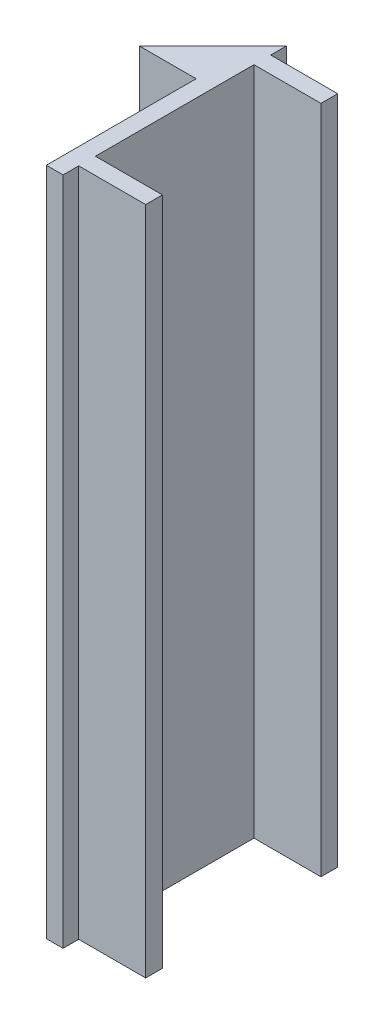
ISO-10303-21;
HEADER;
FILE_DESCRIPTION(('STEP AP214'),'2;1');
FILE_NAME('part.step','',(''),(''),'','','');
FILE_SCHEMA(('AUTOMOTIVE_DESIGN { 1 0 10303 214 1 1 1 1 }'));
ENDSEC;
DATA;
#1=APPLICATION_CONTEXT('core data for automotive mechanical design processes');
#2=APPLICATION_PROTOCOL_DEFINITION('international standard','automotive_design',2000,#1);
#3=PRODUCT_CONTEXT('',#1,'mechanical');
#4=PRODUCT('Part','Part','',(#3));
#5=PRODUCT_RELATED_PRODUCT_CATEGORY('part','',(#4));
#6=PRODUCT_DEFINITION_FORMATION('','',#4);
#7=PRODUCT_DEFINITION_CONTEXT('part definition',#1,'design');
#8=PRODUCT_DEFINITION('design','',#6,#7);
#9=PRODUCT_DEFINITION_SHAPE('','',#8);
#10=(LENGTH_UNIT() NAMED_UNIT(*) SI_UNIT(.MILLI.,.METRE.));
#11=(NAMED_UNIT(*) PLANE_ANGLE_UNIT() SI_UNIT($,.RADIAN.));
#12=(NAMED_UNIT(*) SI_UNIT($,.STERADIAN.) SOLID_ANGLE_UNIT());
#13=UNCERTAINTY_MEASURE_WITH_UNIT(LENGTH_MEASURE(1.E-05),#10,'distance_accuracy_value','');
#14=(GEOMETRIC_REPRESENTATION_CONTEXT(3) GLOBAL_UNCERTAINTY_ASSIGNED_CONTEXT((#13)) GLOBAL_UNIT_ASSIGNED_CONTEXT((#10,
#11,#12)) REPRESENTATION_CONTEXT('',''));
#15=CARTESIAN_POINT('',(0.,0.,0.));
#16=DIRECTION('',(0.,0.,1.));
#17=DIRECTION('',(1.,0.,0.));
#18=AXIS2_PLACEMENT_3D('',#15,#16,#17);
#19=CARTESIAN_POINT('',(12.7,25.,25.1));
#20=DIRECTION('',(0.,0.,-1.));
#21=DIRECTION('',(-1.,0.,0.));
#22=AXIS2_PLACEMENT_3D('',#19,#20,#21);
#23=CYLINDRICAL_SURFACE('',#22,2.49999999999999);
#24=CARTESIAN_POINT('',(12.7,25.,0.));
#25=DIRECTION('',(0.,0.,-1.));
#26=DIRECTION('',(-1.,0.,0.));
#27=AXIS2_PLACEMENT_3D('',#24,#25,#26);
#28=CIRCLE('',#27,2.49999999999999);
#29=CARTESIAN_POINT('',(10.2,25.,0.));
#30=VERTEX_POINT('',#29);
#31=EDGE_CURVE('E221',#30,#30,#28,.F.);
#32=ORIENTED_EDGE('',*,*,#31,.T.);
#33=EDGE_LOOP('',(#32));
#34=FACE_BOUND('',#33,.T.);
#35=CARTESIAN_POINT('',(12.7,25.,-6.90000000000002));
#36=DIRECTION('',(0.,0.,-1.));
#37=DIRECTION('',(-1.,0.,0.));
#38=AXIS2_PLACEMENT_3D('',#35,#36,#37);
#39=CIRCLE('',#38,2.49999999999999);
#40=CARTESIAN_POINT('',(10.2,25.,-6.90000000000002));
#41=VERTEX_POINT('',#40);
#42=EDGE_CURVE('E242',#41,#41,#39,.T.);
#43=ORIENTED_EDGE('',*,*,#42,.T.);
#44=EDGE_LOOP('',(#43));
#45=FACE_BOUND('',#44,.T.);
#46=ADVANCED_FACE('F39',(#34,#45),#23,.F.);
#47=CARTESIAN_POINT('',(12.7,99.9999999999999,25.1));
#48=DIRECTION('',(0.,0.,-1.));
#49=DIRECTION('',(-1.,0.,0.));
#50=AXIS2_PLACEMENT_3D('',#47,#48,#49);
#51=CYLINDRICAL_SURFACE('',#50,2.5);
#52=CARTESIAN_POINT('',(12.7,99.9999999999999,0.));
#53=DIRECTION('',(0.,0.,-1.));
#54=DIRECTION('',(-1.,0.,0.));
#55=AXIS2_PLACEMENT_3D('',#52,#53,#54);
#56=CIRCLE('',#55,2.5);
#57=CARTESIAN_POINT('',(10.2,99.9999999999999,0.));
#58=VERTEX_POINT('',#57);
#59=EDGE_CURVE('E224',#58,#58,#56,.F.);
#60=ORIENTED_EDGE('',*,*,#59,.T.);
#61=EDGE_LOOP('',(#60));
#62=FACE_BOUND('',#61,.T.);
#63=CARTESIAN_POINT('',(12.7,99.9999999999999,-6.90000000000002));
#64=DIRECTION('',(0.,0.,-1.));
#65=DIRECTION('',(-1.,0.,0.));
#66=AXIS2_PLACEMENT_3D('',#63,#64,#65);
#67=CIRCLE('',#66,2.5);
#68=CARTESIAN_POINT('',(10.2,99.9999999999999,-6.90000000000002));
#69=VERTEX_POINT('',#68);
#70=EDGE_CURVE('E239',#69,#69,#67,.T.);
#71=ORIENTED_EDGE('',*,*,#70,.T.);
#72=EDGE_LOOP('',(#71));
#73=FACE_BOUND('',#72,.T.);
#74=ADVANCED_FACE('F277',(#62,#73),#51,.F.);
#75=CARTESIAN_POINT('',(12.7,200.,25.1));
#76=DIRECTION('',(0.,0.,-1.));
#77=DIRECTION('',(-1.,0.,0.));
#78=AXIS2_PLACEMENT_3D('',#75,#76,#77);
#79=CYLINDRICAL_SURFACE('',#78,2.5);
#80=CARTESIAN_POINT('',(12.7,200.,0.));
#81=DIRECTION('',(0.,0.,-1.));
#82=DIRECTION('',(-1.,0.,0.));
#83=AXIS2_PLACEMENT_3D('',#80,#81,#82);
#84=CIRCLE('',#83,2.5);
#85=CARTESIAN_POINT('',(10.2,200.,0.));
#86=VERTEX_POINT('',#85);
#87=EDGE_CURVE('E227',#86,#86,#84,.F.);
#88=ORIENTED_EDGE('',*,*,#87,.T.);
#89=EDGE_LOOP('',(#88));
#90=FACE_BOUND('',#89,.T.);
#91=CARTESIAN_POINT('',(12.7,200.,-6.90000000000002));
#92=DIRECTION('',(0.,0.,-1.));
#93=DIRECTION('',(-1.,0.,0.));
#94=AXIS2_PLACEMENT_3D('',#91,#92,#93);
#95=CIRCLE('',#94,2.5);
#96=CARTESIAN_POINT('',(10.2,200.,-6.90000000000002));
#97=VERTEX_POINT('',#96);
#98=EDGE_CURVE('E235',#97,#97,#95,.T.);
#99=ORIENTED_EDGE('',*,*,#98,.T.);
#100=EDGE_LOOP('',(#99));
#101=FACE_BOUND('',#100,.T.);
#102=ADVANCED_FACE('F284',(#90,#101),#79,.F.);
#103=CARTESIAN_POINT('',(12.7,275.,25.1));
#104=DIRECTION('',(0.,0.,-1.));
#105=DIRECTION('',(-1.,0.,0.));
#106=AXIS2_PLACEMENT_3D('',#103,#104,#105);
#107=CYLINDRICAL_SURFACE('',#106,2.5);
#108=CARTESIAN_POINT('',(12.7,275.,0.));
#109=DIRECTION('',(0.,0.,-1.));
#110=DIRECTION('',(-1.,0.,0.));
#111=AXIS2_PLACEMENT_3D('',#108,#109,#110);
#112=CIRCLE('',#111,2.5);
#113=CARTESIAN_POINT('',(10.2,275.,0.));
#114=VERTEX_POINT('',#113);
#115=EDGE_CURVE('E172',#114,#114,#112,.F.);
#116=ORIENTED_EDGE('',*,*,#115,.T.);
#117=EDGE_LOOP('',(#116));
#118=FACE_BOUND('',#117,.T.);
#119=CARTESIAN_POINT('',(12.7,275.,-6.90000000000002));
#120=DIRECTION('',(0.,0.,-1.));
#121=DIRECTION('',(-1.,0.,0.));
#122=AXIS2_PLACEMENT_3D('',#119,#120,#121);
#123=CIRCLE('',#122,2.5);
#124=CARTESIAN_POINT('',(10.2,275.,-6.90000000000002));
#125=VERTEX_POINT('',#124);
#126=EDGE_CURVE('E232',#125,#125,#123,.T.);
#127=ORIENTED_EDGE('',*,*,#126,.T.);
#128=EDGE_LOOP('',(#127));
#129=FACE_BOUND('',#128,.T.);
#130=ADVANCED_FACE('F336',(#118,#129),#107,.F.);
#131=CARTESIAN_POINT('',(0.,300.,0.));
#132=DIRECTION('',(0.707106781186548,0.,0.707106781186547));
#133=DIRECTION('',(0.707106781186547,0.,-0.707106781186548));
#134=AXIS2_PLACEMENT_3D('',#131,#132,#133);
#135=PLANE('',#134);
#136=CARTESIAN_POINT('',(12.7,275.,-12.7));
#137=DIRECTION('',(0.707106781186548,0.,0.707106781186547));
#138=DIRECTION('',(0.707106781186547,0.,-0.707106781186548));
#139=AXIS2_PLACEMENT_3D('',#136,#137,#138);
#140=ELLIPSE('',#139,7.07106781186548,5.);
#141=CARTESIAN_POINT('',(17.7,275.,-17.7));
#142=VERTEX_POINT('',#141);
#143=EDGE_CURVE('E43',#142,#142,#140,.T.);
#144=ORIENTED_EDGE('',*,*,#143,.T.);
#145=EDGE_LOOP('',(#144));
#146=FACE_BOUND('',#145,.T.);
#147=CARTESIAN_POINT('',(12.7,200.,-12.7));
#148=DIRECTION('',(0.707106781186548,0.,0.707106781186547));
#149=DIRECTION('',(0.707106781186547,0.,-0.707106781186548));
#150=AXIS2_PLACEMENT_3D('',#147,#148,#149);
#151=ELLIPSE('',#150,7.07106781186548,5.);
#152=CARTESIAN_POINT('',(17.7,200.,-17.7));
#153=VERTEX_POINT('',#152);
#154=EDGE_CURVE('E250',#153,#153,#151,.T.);
#155=ORIENTED_EDGE('',*,*,#154,.T.);
#156=EDGE_LOOP('',(#155));
#157=FACE_BOUND('',#156,.T.);
#158=CARTESIAN_POINT('',(12.7,99.9999999999999,-12.7));
#159=DIRECTION('',(0.707106781186548,0.,0.707106781186547));
#160=DIRECTION('',(0.707106781186547,0.,-0.707106781186548));
#161=AXIS2_PLACEMENT_3D('',#158,#159,#160);
#162=ELLIPSE('',#161,7.07106781186548,5.);
#163=CARTESIAN_POINT('',(17.7,99.9999999999999,-17.7));
#164=VERTEX_POINT('',#163);
#165=EDGE_CURVE('E248',#164,#164,#162,.T.);
#166=ORIENTED_EDGE('',*,*,#165,.T.);
#167=EDGE_LOOP('',(#166));
#168=FACE_BOUND('',#167,.T.);
#169=CARTESIAN_POINT('',(12.7,25.,-12.7));
#170=DIRECTION('',(0.707106781186548,0.,0.707106781186547));
#171=DIRECTION('',(0.707106781186547,0.,-0.707106781186548));
#172=AXIS2_PLACEMENT_3D('',#169,#170,#171);
#173=ELLIPSE('',#172,7.07106781186548,5.);
#174=CARTESIAN_POINT('',(17.7,25.,-17.7));
#175=VERTEX_POINT('',#174);
#176=EDGE_CURVE('E245',#175,#175,#173,.T.);
#177=ORIENTED_EDGE('',*,*,#176,.T.);
#178=EDGE_LOOP('',(#177));
#179=FACE_BOUND('',#178,.T.);
#180=DIRECTION('',(-0.707106781186547,0.,0.707106781186548));
#181=VECTOR('',#180,1.);
#182=CARTESIAN_POINT('',(0.,0.,0.));
#183=LINE('',#182,#181);
#184=CARTESIAN_POINT('',(32.9,0.,-32.9));
#185=VERTEX_POINT('',#184);
#186=CARTESIAN_POINT('',(0.,0.,0.));
#187=VERTEX_POINT('',#186);
#188=EDGE_CURVE('E168',#185,#187,#183,.T.);
#189=ORIENTED_EDGE('',*,*,#188,.T.);
#190=DIRECTION('',(0.,-1.,0.));
#191=VECTOR('',#190,1.);
#192=CARTESIAN_POINT('',(0.,300.,0.));
#193=LINE('',#192,#191);
#194=CARTESIAN_POINT('',(0.,300.,0.));
#195=VERTEX_POINT('',#194);
#196=EDGE_CURVE('E11',#195,#187,#193,.T.);
#197=ORIENTED_EDGE('',*,*,#196,.F.);
#198=DIRECTION('',(-0.707106781186547,0.,0.707106781186548));
#199=VECTOR('',#198,1.);
#200=CARTESIAN_POINT('',(0.,300.,0.));
#201=LINE('',#200,#199);
#202=CARTESIAN_POINT('',(32.9,300.,-32.9));
#203=VERTEX_POINT('',#202);
#204=EDGE_CURVE('E194',#203,#195,#201,.T.);
#205=ORIENTED_EDGE('',*,*,#204,.F.);
#206=DIRECTION('',(0.,-1.,0.));
#207=VECTOR('',#206,1.);
#208=CARTESIAN_POINT('',(32.9,300.,-32.9));
#209=LINE('',#208,#207);
#210=EDGE_CURVE('E164',#203,#185,#209,.T.);
#211=ORIENTED_EDGE('',*,*,#210,.T.);
#212=EDGE_LOOP('',(#189,#197,#205,#211));
#213=FACE_BOUND('',#212,.T.);
#214=ADVANCED_FACE('F41',(#146,#157,#168,#179,#213),#135,.F.);
#215=CARTESIAN_POINT('',(0.,300.,0.));
#216=DIRECTION('',(0.,0.,-1.));
#217=DIRECTION('',(-1.,0.,0.));
#218=AXIS2_PLACEMENT_3D('',#215,#216,#217);
#219=PLANE('',#218);
#220=ORIENTED_EDGE('',*,*,#115,.F.);
#221=EDGE_LOOP('',(#220));
#222=FACE_BOUND('',#221,.T.);
#223=ORIENTED_EDGE('',*,*,#87,.F.);
#224=EDGE_LOOP('',(#223));
#225=FACE_BOUND('',#224,.T.);
#226=ORIENTED_EDGE('',*,*,#59,.F.);
#227=EDGE_LOOP('',(#226));
#228=FACE_BOUND('',#227,.T.);
#229=ORIENTED_EDGE('',*,*,#31,.F.);
#230=EDGE_LOOP('',(#229));
#231=FACE_BOUND('',#230,.T.);
#232=DIRECTION('',(1.,0.,0.));
#233=VECTOR('',#232,1.);
#234=CARTESIAN_POINT('',(0.,0.,0.));
#235=LINE('',#234,#233);
#236=CARTESIAN_POINT('',(25.4,0.,0.));
#237=VERTEX_POINT('',#236);
#238=EDGE_CURVE('E171',#187,#237,#235,.T.);
#239=ORIENTED_EDGE('',*,*,#238,.T.);
#240=DIRECTION('',(0.,-1.,0.));
#241=VECTOR('',#240,1.);
#242=CARTESIAN_POINT('',(25.4,300.,0.));
#243=LINE('',#242,#241);
#244=CARTESIAN_POINT('',(25.4,300.,0.));
#245=VERTEX_POINT('',#244);
#246=EDGE_CURVE('E49',#245,#237,#243,.T.);
#247=ORIENTED_EDGE('',*,*,#246,.F.);
#248=DIRECTION('',(1.,0.,0.));
#249=VECTOR('',#248,1.);
#250=CARTESIAN_POINT('',(0.,300.,0.));
#251=LINE('',#250,#249);
#252=EDGE_CURVE('E116',#195,#245,#251,.T.);
#253=ORIENTED_EDGE('',*,*,#252,.F.);
#254=ORIENTED_EDGE('',*,*,#196,.T.);
#255=EDGE_LOOP('',(#239,#247,#253,#254));
#256=FACE_BOUND('',#255,.T.);
#257=ADVANCED_FACE('F329',(#222,#225,#228,#231,#256),#219,.F.);
#258=CARTESIAN_POINT('',(25.4,300.,50.8));
#259=DIRECTION('',(1.,0.,0.));
#260=DIRECTION('',(0.,0.,-1.));
#261=AXIS2_PLACEMENT_3D('',#258,#259,#260);
#262=PLANE('',#261);
#263=DIRECTION('',(0.,0.,1.));
#264=VECTOR('',#263,1.);
#265=CARTESIAN_POINT('',(25.4,0.,50.8));
#266=LINE('',#265,#264);
#267=CARTESIAN_POINT('',(25.4,0.,67.1));
#268=VERTEX_POINT('',#267);
#269=EDGE_CURVE('E175',#237,#268,#266,.T.);
#270=ORIENTED_EDGE('',*,*,#269,.T.);
#271=DIRECTION('',(0.,-1.,0.));
#272=VECTOR('',#271,1.);
#273=CARTESIAN_POINT('',(25.4,300.,67.1));
#274=LINE('',#273,#272);
#275=CARTESIAN_POINT('',(25.4,300.,67.1));
#276=VERTEX_POINT('',#275);
#277=EDGE_CURVE('E216',#276,#268,#274,.T.);
#278=ORIENTED_EDGE('',*,*,#277,.F.);
#279=DIRECTION('',(0.,0.,1.));
#280=VECTOR('',#279,1.);
#281=CARTESIAN_POINT('',(25.4,300.,0.));
#282=LINE('',#281,#280);
#283=EDGE_CURVE('E348',#245,#276,#282,.T.);
#284=ORIENTED_EDGE('',*,*,#283,.F.);
#285=ORIENTED_EDGE('',*,*,#246,.T.);
#286=EDGE_LOOP('',(#270,#278,#284,#285));
#287=FACE_BOUND('',#286,.T.);
#288=ADVANCED_FACE('F326',(#287),#262,.F.);
#289=CARTESIAN_POINT('',(25.4,300.,67.1));
#290=DIRECTION('',(0.,0.,-1.));
#291=DIRECTION('',(-1.,0.,0.));
#292=AXIS2_PLACEMENT_3D('',#289,#290,#291);
#293=PLANE('',#292);
#294=DIRECTION('',(1.,0.,0.));
#295=VECTOR('',#294,1.);
#296=CARTESIAN_POINT('',(25.4,0.,67.1));
#297=LINE('',#296,#295);
#298=CARTESIAN_POINT('',(32.9,0.,67.1));
#299=VERTEX_POINT('',#298);
#300=EDGE_CURVE('E177',#268,#299,#297,.T.);
#301=ORIENTED_EDGE('',*,*,#300,.T.);
#302=DIRECTION('',(0.,-1.,0.));
#303=VECTOR('',#302,1.);
#304=CARTESIAN_POINT('',(32.9,300.,67.1));
#305=LINE('',#304,#303);
#306=CARTESIAN_POINT('',(32.9,300.,67.1));
#307=VERTEX_POINT('',#306);
#308=EDGE_CURVE('E213',#307,#299,#305,.T.);
#309=ORIENTED_EDGE('',*,*,#308,.F.);
#310=DIRECTION('',(1.,0.,0.));
#311=VECTOR('',#310,1.);
#312=CARTESIAN_POINT('',(25.4,300.,67.1));
#313=LINE('',#312,#311);
#314=EDGE_CURVE('E350',#276,#307,#313,.T.);
#315=ORIENTED_EDGE('',*,*,#314,.F.);
#316=ORIENTED_EDGE('',*,*,#277,.T.);
#317=EDGE_LOOP('',(#301,#309,#315,#316));
#318=FACE_BOUND('',#317,.T.);
#319=ADVANCED_FACE('F322',(#318),#293,.F.);
#320=CARTESIAN_POINT('',(32.9,300.,67.1));
#321=DIRECTION('',(-1.,0.,0.));
#322=DIRECTION('',(0.,0.,1.));
#323=AXIS2_PLACEMENT_3D('',#320,#321,#322);
#324=PLANE('',#323);
#325=DIRECTION('',(0.,0.,-1.));
#326=VECTOR('',#325,1.);
#327=CARTESIAN_POINT('',(32.9,0.,67.1));
#328=LINE('',#327,#326);
#329=CARTESIAN_POINT('',(32.9,0.,60.1));
#330=VERTEX_POINT('',#329);
#331=EDGE_CURVE('E179',#299,#330,#328,.T.);
#332=ORIENTED_EDGE('',*,*,#331,.T.);
#333=DIRECTION('',(0.,-1.,0.));
#334=VECTOR('',#333,1.);
#335=CARTESIAN_POINT('',(32.9,300.,60.1));
#336=LINE('',#335,#334);
#337=CARTESIAN_POINT('',(32.9,300.,60.1));
#338=VERTEX_POINT('',#337);
#339=EDGE_CURVE('E210',#338,#330,#336,.T.);
#340=ORIENTED_EDGE('',*,*,#339,.F.);
#341=DIRECTION('',(0.,0.,-1.));
#342=VECTOR('',#341,1.);
#343=CARTESIAN_POINT('',(32.9,300.,67.1));
#344=LINE('',#343,#342);
#345=EDGE_CURVE('E352',#307,#338,#344,.T.);
#346=ORIENTED_EDGE('',*,*,#345,.F.);
#347=ORIENTED_EDGE('',*,*,#308,.T.);
#348=EDGE_LOOP('',(#332,#340,#346,#347));
#349=FACE_BOUND('',#348,.T.);
#350=ADVANCED_FACE('F318',(#349),#324,.F.);
#351=CARTESIAN_POINT('',(32.9,300.,60.1));
#352=DIRECTION('',(0.,0.,-1.));
#353=DIRECTION('',(-1.,0.,0.));
#354=AXIS2_PLACEMENT_3D('',#351,#352,#353);
#355=PLANE('',#354);
#356=DIRECTION('',(1.,0.,0.));
#357=VECTOR('',#356,1.);
#358=CARTESIAN_POINT('',(32.9,0.,60.1));
#359=LINE('',#358,#357);
#360=CARTESIAN_POINT('',(62.9,0.,60.1));
#361=VERTEX_POINT('',#360);
#362=EDGE_CURVE('E181',#330,#361,#359,.T.);
#363=ORIENTED_EDGE('',*,*,#362,.T.);
#364=DIRECTION('',(0.,-1.,0.));
#365=VECTOR('',#364,1.);
#366=CARTESIAN_POINT('',(62.9,300.,60.1));
#367=LINE('',#366,#365);
#368=CARTESIAN_POINT('',(62.9,300.,60.1));
#369=VERTEX_POINT('',#368);
#370=EDGE_CURVE('E207',#369,#361,#367,.T.);
#371=ORIENTED_EDGE('',*,*,#370,.F.);
#372=DIRECTION('',(1.,0.,0.));
#373=VECTOR('',#372,1.);
#374=CARTESIAN_POINT('',(32.9,300.,60.1));
#375=LINE('',#374,#373);
#376=EDGE_CURVE('E358',#338,#369,#375,.T.);
#377=ORIENTED_EDGE('',*,*,#376,.F.);
#378=ORIENTED_EDGE('',*,*,#339,.T.);
#379=EDGE_LOOP('',(#363,#371,#377,#378));
#380=FACE_BOUND('',#379,.T.);
#381=ADVANCED_FACE('F314',(#380),#355,.F.);
#382=CARTESIAN_POINT('',(62.9,300.,60.1));
#383=DIRECTION('',(-1.,0.,0.));
#384=DIRECTION('',(0.,0.,1.));
#385=AXIS2_PLACEMENT_3D('',#382,#383,#384);
#386=PLANE('',#385);
#387=DIRECTION('',(0.,0.,-1.));
#388=VECTOR('',#387,1.);
#389=CARTESIAN_POINT('',(62.9,0.,60.1));
#390=LINE('',#389,#388);
#391=CARTESIAN_POINT('',(62.9,0.,52.6));
#392=VERTEX_POINT('',#391);
#393=EDGE_CURVE('E183',#361,#392,#390,.T.);
#394=ORIENTED_EDGE('',*,*,#393,.T.);
#395=DIRECTION('',(0.,-1.,0.));
#396=VECTOR('',#395,1.);
#397=CARTESIAN_POINT('',(62.9,300.,52.6));
#398=LINE('',#397,#396);
#399=CARTESIAN_POINT('',(62.9,300.,52.6));
#400=VERTEX_POINT('',#399);
#401=EDGE_CURVE('E204',#400,#392,#398,.T.);
#402=ORIENTED_EDGE('',*,*,#401,.F.);
#403=DIRECTION('',(0.,0.,-1.));
#404=VECTOR('',#403,1.);
#405=CARTESIAN_POINT('',(62.9,300.,60.1));
#406=LINE('',#405,#404);
#407=EDGE_CURVE('E360',#369,#400,#406,.T.);
#408=ORIENTED_EDGE('',*,*,#407,.F.);
#409=ORIENTED_EDGE('',*,*,#370,.T.);
#410=EDGE_LOOP('',(#394,#402,#408,#409));
#411=FACE_BOUND('',#410,.T.);
#412=ADVANCED_FACE('F310',(#411),#386,.F.);
#413=CARTESIAN_POINT('',(32.9,300.,52.6));
#414=DIRECTION('',(0.,0.,1.));
#415=DIRECTION('',(1.,0.,0.));
#416=AXIS2_PLACEMENT_3D('',#413,#414,#415);
#417=PLANE('',#416);
#418=DIRECTION('',(-1.,0.,0.));
#419=VECTOR('',#418,1.);
#420=CARTESIAN_POINT('',(32.9,0.,52.6));
#421=LINE('',#420,#419);
#422=CARTESIAN_POINT('',(32.9,0.,52.6));
#423=VERTEX_POINT('',#422);
#424=EDGE_CURVE('E185',#392,#423,#421,.T.);
#425=ORIENTED_EDGE('',*,*,#424,.T.);
#426=DIRECTION('',(0.,-1.,0.));
#427=VECTOR('',#426,1.);
#428=CARTESIAN_POINT('',(32.9,300.,52.6));
#429=LINE('',#428,#427);
#430=CARTESIAN_POINT('',(32.9,300.,52.6));
#431=VERTEX_POINT('',#430);
#432=EDGE_CURVE('E201',#431,#423,#429,.T.);
#433=ORIENTED_EDGE('',*,*,#432,.F.);
#434=DIRECTION('',(-1.,0.,0.));
#435=VECTOR('',#434,1.);
#436=CARTESIAN_POINT('',(32.9,300.,52.6));
#437=LINE('',#436,#435);
#438=EDGE_CURVE('E362',#400,#431,#437,.T.);
#439=ORIENTED_EDGE('',*,*,#438,.F.);
#440=ORIENTED_EDGE('',*,*,#401,.T.);
#441=EDGE_LOOP('',(#425,#433,#439,#440));
#442=FACE_BOUND('',#441,.T.);
#443=ADVANCED_FACE('F306',(#442),#417,.F.);
#444=CARTESIAN_POINT('',(32.9,300.,-18.4));
#445=DIRECTION('',(-1.,0.,0.));
#446=DIRECTION('',(0.,0.,1.));
#447=AXIS2_PLACEMENT_3D('',#444,#445,#446);
#448=PLANE('',#447);
#449=DIRECTION('',(0.,0.,-1.));
#450=VECTOR('',#449,1.);
#451=CARTESIAN_POINT('',(32.9,0.,-18.4));
#452=LINE('',#451,#450);
#453=CARTESIAN_POINT('',(32.9,0.,-18.4));
#454=VERTEX_POINT('',#453);
#455=EDGE_CURVE('E187',#423,#454,#452,.T.);
#456=ORIENTED_EDGE('',*,*,#455,.T.);
#457=DIRECTION('',(0.,-1.,0.));
#458=VECTOR('',#457,1.);
#459=CARTESIAN_POINT('',(32.9,300.,-18.4));
#460=LINE('',#459,#458);
#461=CARTESIAN_POINT('',(32.9,300.,-18.4));
#462=VERTEX_POINT('',#461);
#463=EDGE_CURVE('E198',#462,#454,#460,.T.);
#464=ORIENTED_EDGE('',*,*,#463,.F.);
#465=DIRECTION('',(0.,0.,-1.));
#466=VECTOR('',#465,1.);
#467=CARTESIAN_POINT('',(32.9,300.,-18.4));
#468=LINE('',#467,#466);
#469=EDGE_CURVE('E364',#431,#462,#468,.T.);
#470=ORIENTED_EDGE('',*,*,#469,.F.);
#471=ORIENTED_EDGE('',*,*,#432,.T.);
#472=EDGE_LOOP('',(#456,#464,#470,#471));
#473=FACE_BOUND('',#472,.T.);
#474=ADVANCED_FACE('F302',(#473),#448,.F.);
#475=CARTESIAN_POINT('',(32.9,300.,-18.4));
#476=DIRECTION('',(0.,0.,-1.));
#477=DIRECTION('',(-1.,0.,0.));
#478=AXIS2_PLACEMENT_3D('',#475,#476,#477);
#479=PLANE('',#478);
#480=DIRECTION('',(1.,0.,0.));
#481=VECTOR('',#480,1.);
#482=CARTESIAN_POINT('',(32.9,0.,-18.4));
#483=LINE('',#482,#481);
#484=CARTESIAN_POINT('',(62.9,0.,-18.4));
#485=VERTEX_POINT('',#484);
#486=EDGE_CURVE('E189',#454,#485,#483,.T.);
#487=ORIENTED_EDGE('',*,*,#486,.T.);
#488=DIRECTION('',(0.,-1.,0.));
#489=VECTOR('',#488,1.);
#490=CARTESIAN_POINT('',(62.9,300.,-18.4));
#491=LINE('',#490,#489);
#492=CARTESIAN_POINT('',(62.9,300.,-18.4));
#493=VERTEX_POINT('',#492);
#494=EDGE_CURVE('E159',#493,#485,#491,.T.);
#495=ORIENTED_EDGE('',*,*,#494,.F.);
#496=DIRECTION('',(1.,0.,0.));
#497=VECTOR('',#496,1.);
#498=CARTESIAN_POINT('',(32.9,300.,-18.4));
#499=LINE('',#498,#497);
#500=EDGE_CURVE('E150',#462,#493,#499,.T.);
#501=ORIENTED_EDGE('',*,*,#500,.F.);
#502=ORIENTED_EDGE('',*,*,#463,.T.);
#503=EDGE_LOOP('',(#487,#495,#501,#502));
#504=FACE_BOUND('',#503,.T.);
#505=ADVANCED_FACE('F299',(#504),#479,.F.);
#506=CARTESIAN_POINT('',(62.9,300.,-18.4));
#507=DIRECTION('',(-1.,0.,0.));
#508=DIRECTION('',(0.,0.,1.));
#509=AXIS2_PLACEMENT_3D('',#506,#507,#508);
#510=PLANE('',#509);
#511=DIRECTION('',(0.,0.,-1.));
#512=VECTOR('',#511,1.);
#513=CARTESIAN_POINT('',(62.9,0.,-18.4));
#514=LINE('',#513,#512);
#515=CARTESIAN_POINT('',(62.9,0.,-25.9));
#516=VERTEX_POINT('',#515);
#517=EDGE_CURVE('E158',#485,#516,#514,.T.);
#518=ORIENTED_EDGE('',*,*,#517,.T.);
#519=DIRECTION('',(0.,-1.,0.));
#520=VECTOR('',#519,1.);
#521=CARTESIAN_POINT('',(62.9,300.,-25.9));
#522=LINE('',#521,#520);
#523=CARTESIAN_POINT('',(62.9,300.,-25.9));
#524=VERTEX_POINT('',#523);
#525=EDGE_CURVE('E155',#524,#516,#522,.T.);
#526=ORIENTED_EDGE('',*,*,#525,.F.);
#527=DIRECTION('',(0.,0.,-1.));
#528=VECTOR('',#527,1.);
#529=CARTESIAN_POINT('',(62.9,300.,-18.4));
#530=LINE('',#529,#528);
#531=EDGE_CURVE('E144',#493,#524,#530,.T.);
#532=ORIENTED_EDGE('',*,*,#531,.F.);
#533=ORIENTED_EDGE('',*,*,#494,.T.);
#534=EDGE_LOOP('',(#518,#526,#532,#533));
#535=FACE_BOUND('',#534,.T.);
#536=ADVANCED_FACE('F156',(#535),#510,.F.);
#537=CARTESIAN_POINT('',(32.9,300.,-25.9));
#538=DIRECTION('',(0.,0.,1.));
#539=DIRECTION('',(1.,0.,0.));
#540=AXIS2_PLACEMENT_3D('',#537,#538,#539);
#541=PLANE('',#540);
#542=DIRECTION('',(-1.,0.,0.));
#543=VECTOR('',#542,1.);
#544=CARTESIAN_POINT('',(32.9,0.,-25.9));
#545=LINE('',#544,#543);
#546=CARTESIAN_POINT('',(32.9,0.,-25.9));
#547=VERTEX_POINT('',#546);
#548=EDGE_CURVE('E102',#516,#547,#545,.T.);
#549=ORIENTED_EDGE('',*,*,#548,.T.);
#550=DIRECTION('',(0.,-1.,0.));
#551=VECTOR('',#550,1.);
#552=CARTESIAN_POINT('',(32.9,300.,-25.9));
#553=LINE('',#552,#551);
#554=CARTESIAN_POINT('',(32.9,300.,-25.9));
#555=VERTEX_POINT('',#554);
#556=EDGE_CURVE('E160',#555,#547,#553,.T.);
#557=ORIENTED_EDGE('',*,*,#556,.F.);
#558=DIRECTION('',(-1.,0.,0.));
#559=VECTOR('',#558,1.);
#560=CARTESIAN_POINT('',(32.9,300.,-25.9));
#561=LINE('',#560,#559);
#562=EDGE_CURVE('E148',#524,#555,#561,.T.);
#563=ORIENTED_EDGE('',*,*,#562,.F.);
#564=ORIENTED_EDGE('',*,*,#525,.T.);
#565=EDGE_LOOP('',(#549,#557,#563,#564));
#566=FACE_BOUND('',#565,.T.);
#567=ADVANCED_FACE('F162',(#566),#541,.F.);
#568=CARTESIAN_POINT('',(32.9,300.,-32.9));
#569=DIRECTION('',(-1.,0.,0.));
#570=DIRECTION('',(0.,0.,1.));
#571=AXIS2_PLACEMENT_3D('',#568,#569,#570);
#572=PLANE('',#571);
#573=DIRECTION('',(0.,0.,-1.));
#574=VECTOR('',#573,1.);
#575=CARTESIAN_POINT('',(32.9,0.,-32.9));
#576=LINE('',#575,#574);
#577=EDGE_CURVE('E108',#547,#185,#576,.T.);
#578=ORIENTED_EDGE('',*,*,#577,.T.);
#579=ORIENTED_EDGE('',*,*,#210,.F.);
#580=DIRECTION('',(0.,0.,-1.));
#581=VECTOR('',#580,1.);
#582=CARTESIAN_POINT('',(32.9,300.,-32.9));
#583=LINE('',#582,#581);
#584=EDGE_CURVE('E58',#555,#203,#583,.T.);
#585=ORIENTED_EDGE('',*,*,#584,.F.);
#586=ORIENTED_EDGE('',*,*,#556,.T.);
#587=EDGE_LOOP('',(#578,#579,#585,#586));
#588=FACE_BOUND('',#587,.T.);
#589=ADVANCED_FACE('F291',(#588),#572,.F.);
#590=CARTESIAN_POINT('',(0.,300.,0.));
#591=DIRECTION('',(0.,-1.,0.));
#592=DIRECTION('',(0.,0.,-1.));
#593=AXIS2_PLACEMENT_3D('',#590,#591,#592);
#594=PLANE('',#593);
#595=ORIENTED_EDGE('',*,*,#204,.T.);
#596=ORIENTED_EDGE('',*,*,#252,.T.);
#597=ORIENTED_EDGE('',*,*,#283,.T.);
#598=ORIENTED_EDGE('',*,*,#314,.T.);
#599=ORIENTED_EDGE('',*,*,#345,.T.);
#600=ORIENTED_EDGE('',*,*,#376,.T.);
#601=ORIENTED_EDGE('',*,*,#407,.T.);
#602=ORIENTED_EDGE('',*,*,#438,.T.);
#603=ORIENTED_EDGE('',*,*,#469,.T.);
#604=ORIENTED_EDGE('',*,*,#500,.T.);
#605=ORIENTED_EDGE('',*,*,#531,.T.);
#606=ORIENTED_EDGE('',*,*,#562,.T.);
#607=ORIENTED_EDGE('',*,*,#584,.T.);
#608=EDGE_LOOP('',(#595,#596,#597,#598,#599,#600,#601,#602,#603,#604,#605,#606,#607));
#609=FACE_BOUND('',#608,.T.);
#610=ADVANCED_FACE('F146',(#609),#594,.F.);
#611=CARTESIAN_POINT('',(0.,0.,0.));
#612=DIRECTION('',(0.,-1.,0.));
#613=DIRECTION('',(0.,0.,-1.));
#614=AXIS2_PLACEMENT_3D('',#611,#612,#613);
#615=PLANE('',#614);
#616=ORIENTED_EDGE('',*,*,#188,.F.);
#617=ORIENTED_EDGE('',*,*,#577,.F.);
#618=ORIENTED_EDGE('',*,*,#548,.F.);
#619=ORIENTED_EDGE('',*,*,#517,.F.);
#620=ORIENTED_EDGE('',*,*,#486,.F.);
#621=ORIENTED_EDGE('',*,*,#455,.F.);
#622=ORIENTED_EDGE('',*,*,#424,.F.);
#623=ORIENTED_EDGE('',*,*,#393,.F.);
#624=ORIENTED_EDGE('',*,*,#362,.F.);
#625=ORIENTED_EDGE('',*,*,#331,.F.);
#626=ORIENTED_EDGE('',*,*,#300,.F.);
#627=ORIENTED_EDGE('',*,*,#269,.F.);
#628=ORIENTED_EDGE('',*,*,#238,.F.);
#629=EDGE_LOOP('',(#616,#617,#618,#619,#620,#621,#622,#623,#624,#625,#626,#627,#628));
#630=FACE_BOUND('',#629,.T.);
#631=ADVANCED_FACE('F261',(#630),#615,.T.);
#632=CARTESIAN_POINT('',(12.7,275.,-6.90000000000002));
#633=DIRECTION('',(0.,0.,-1.));
#634=DIRECTION('',(-1.,0.,0.));
#635=AXIS2_PLACEMENT_3D('',#632,#633,#634);
#636=CYLINDRICAL_SURFACE('',#635,5.);
#637=CARTESIAN_POINT('',(12.7,275.,-6.90000000000002));
#638=DIRECTION('',(0.,0.,-1.));
#639=DIRECTION('',(-1.,0.,0.));
#640=AXIS2_PLACEMENT_3D('',#637,#638,#639);
#641=CIRCLE('',#640,5.);
#642=CARTESIAN_POINT('',(7.7,275.,-6.90000000000002));
#643=VERTEX_POINT('',#642);
#644=EDGE_CURVE('E236',#643,#643,#641,.T.);
#645=ORIENTED_EDGE('',*,*,#644,.F.);
#646=EDGE_LOOP('',(#645));
#647=FACE_BOUND('',#646,.T.);
#648=ORIENTED_EDGE('',*,*,#143,.F.);
#649=EDGE_LOOP('',(#648));
#650=FACE_BOUND('',#649,.T.);
#651=ADVANCED_FACE('F258',(#647,#650),#636,.F.);
#652=CARTESIAN_POINT('',(12.7,275.,-6.90000000000002));
#653=DIRECTION('',(0.,0.,-1.));
#654=DIRECTION('',(-1.,0.,0.));
#655=AXIS2_PLACEMENT_3D('',#652,#653,#654);
#656=PLANE('',#655);
#657=ORIENTED_EDGE('',*,*,#126,.F.);
#658=EDGE_LOOP('',(#657));
#659=FACE_BOUND('',#658,.T.);
#660=ORIENTED_EDGE('',*,*,#644,.T.);
#661=EDGE_LOOP('',(#660));
#662=FACE_BOUND('',#661,.T.);
#663=ADVANCED_FACE('F260',(#659,#662),#656,.T.);
#664=CARTESIAN_POINT('',(12.7,200.,-6.90000000000002));
#665=DIRECTION('',(0.,0.,-1.));
#666=DIRECTION('',(-1.,0.,0.));
#667=AXIS2_PLACEMENT_3D('',#664,#665,#666);
#668=CYLINDRICAL_SURFACE('',#667,5.);
#669=CARTESIAN_POINT('',(12.7,200.,-6.90000000000002));
#670=DIRECTION('',(0.,0.,-1.));
#671=DIRECTION('',(-1.,0.,0.));
#672=AXIS2_PLACEMENT_3D('',#669,#670,#671);
#673=CIRCLE('',#672,5.);
#674=CARTESIAN_POINT('',(7.69999999999999,200.,-6.90000000000002));
#675=VERTEX_POINT('',#674);
#676=EDGE_CURVE('E380',#675,#675,#673,.T.);
#677=ORIENTED_EDGE('',*,*,#676,.F.);
#678=EDGE_LOOP('',(#677));
#679=FACE_BOUND('',#678,.T.);
#680=ORIENTED_EDGE('',*,*,#154,.F.);
#681=EDGE_LOOP('',(#680));
#682=FACE_BOUND('',#681,.T.);
#683=ADVANCED_FACE('F268',(#679,#682),#668,.F.);
#684=CARTESIAN_POINT('',(12.7,200.,-6.90000000000002));
#685=DIRECTION('',(0.,0.,-1.));
#686=DIRECTION('',(-1.,0.,0.));
#687=AXIS2_PLACEMENT_3D('',#684,#685,#686);
#688=PLANE('',#687);
#689=ORIENTED_EDGE('',*,*,#98,.F.);
#690=EDGE_LOOP('',(#689));
#691=FACE_BOUND('',#690,.T.);
#692=ORIENTED_EDGE('',*,*,#676,.T.);
#693=EDGE_LOOP('',(#692));
#694=FACE_BOUND('',#693,.T.);
#695=ADVANCED_FACE('F387',(#691,#694),#688,.T.);
#696=CARTESIAN_POINT('',(12.7,99.9999999999999,-6.90000000000002));
#697=DIRECTION('',(0.,0.,-1.));
#698=DIRECTION('',(-1.,0.,0.));
#699=AXIS2_PLACEMENT_3D('',#696,#697,#698);
#700=CYLINDRICAL_SURFACE('',#699,5.);
#701=CARTESIAN_POINT('',(12.7,99.9999999999999,-6.90000000000002));
#702=DIRECTION('',(0.,0.,-1.));
#703=DIRECTION('',(-1.,0.,0.));
#704=AXIS2_PLACEMENT_3D('',#701,#702,#703);
#705=CIRCLE('',#704,5.);
#706=CARTESIAN_POINT('',(7.7,99.9999999999999,-6.90000000000002));
#707=VERTEX_POINT('',#706);
#708=EDGE_CURVE('E377',#707,#707,#705,.T.);
#709=ORIENTED_EDGE('',*,*,#708,.F.);
#710=EDGE_LOOP('',(#709));
#711=FACE_BOUND('',#710,.T.);
#712=ORIENTED_EDGE('',*,*,#165,.F.);
#713=EDGE_LOOP('',(#712));
#714=FACE_BOUND('',#713,.T.);
#715=ADVANCED_FACE('F394',(#711,#714),#700,.F.);
#716=CARTESIAN_POINT('',(12.7,99.9999999999999,-6.90000000000002));
#717=DIRECTION('',(0.,0.,-1.));
#718=DIRECTION('',(-1.,0.,0.));
#719=AXIS2_PLACEMENT_3D('',#716,#717,#718);
#720=PLANE('',#719);
#721=ORIENTED_EDGE('',*,*,#70,.F.);
#722=EDGE_LOOP('',(#721));
#723=FACE_BOUND('',#722,.T.);
#724=ORIENTED_EDGE('',*,*,#708,.T.);
#725=EDGE_LOOP('',(#724));
#726=FACE_BOUND('',#725,.T.);
#727=ADVANCED_FACE('F400',(#723,#726),#720,.T.);
#728=CARTESIAN_POINT('',(12.7,25.,-6.90000000000002));
#729=DIRECTION('',(0.,0.,-1.));
#730=DIRECTION('',(-1.,0.,0.));
#731=AXIS2_PLACEMENT_3D('',#728,#729,#730);
#732=CYLINDRICAL_SURFACE('',#731,5.);
#733=CARTESIAN_POINT('',(12.7,25.,-6.90000000000002));
#734=DIRECTION('',(0.,0.,-1.));
#735=DIRECTION('',(-1.,0.,0.));
#736=AXIS2_PLACEMENT_3D('',#733,#734,#735);
#737=CIRCLE('',#736,5.);
#738=CARTESIAN_POINT('',(7.7,25.,-6.90000000000002));
#739=VERTEX_POINT('',#738);
#740=EDGE_CURVE('E374',#739,#739,#737,.T.);
#741=ORIENTED_EDGE('',*,*,#740,.F.);
#742=EDGE_LOOP('',(#741));
#743=FACE_BOUND('',#742,.T.);
#744=ORIENTED_EDGE('',*,*,#176,.F.);
#745=EDGE_LOOP('',(#744));
#746=FACE_BOUND('',#745,.T.);
#747=ADVANCED_FACE('F404',(#743,#746),#732,.F.);
#748=CARTESIAN_POINT('',(12.7,25.,-6.90000000000002));
#749=DIRECTION('',(0.,0.,-1.));
#750=DIRECTION('',(-1.,0.,0.));
#751=AXIS2_PLACEMENT_3D('',#748,#749,#750);
#752=PLANE('',#751);
#753=ORIENTED_EDGE('',*,*,#42,.F.);
#754=EDGE_LOOP('',(#753));
#755=FACE_BOUND('',#754,.T.);
#756=ORIENTED_EDGE('',*,*,#740,.T.);
#757=EDGE_LOOP('',(#756));
#758=FACE_BOUND('',#757,.T.);
#759=ADVANCED_FACE('F408',(#755,#758),#752,.T.);
#760=CLOSED_SHELL('',(#46,#74,#102,#130,#214,#257,#288,#319,#350,#381,#412,#443,#474,#505,#536,
#567,#589,#610,#631,#651,#663,#683,#695,#715,#727,#747,#759));
#761=MANIFOLD_SOLID_BREP('B2',#760);
#762=ADVANCED_BREP_SHAPE_REPRESENTATION('',(#18,#761),#14);
#763=SHAPE_DEFINITION_REPRESENTATION(#9,#762);
ENDSEC;
END-ISO-10303-21;
